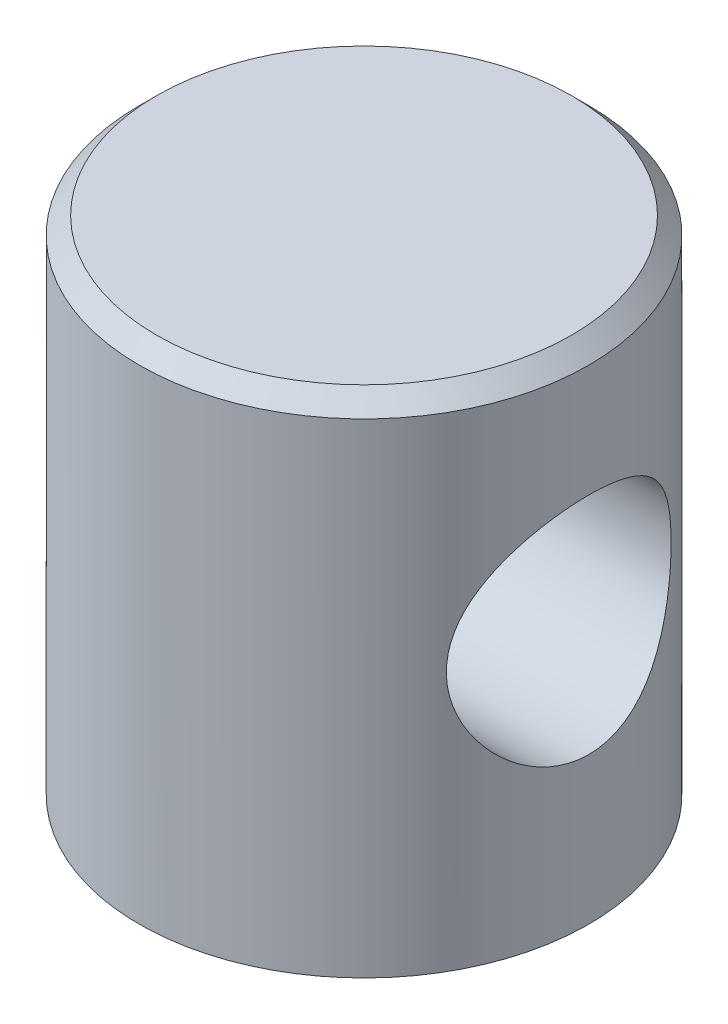
ISO-10303-21;
HEADER;
FILE_DESCRIPTION(('STEP AP214'),'2;1');
FILE_NAME('part.step','',(''),(''),'','','');
FILE_SCHEMA(('AUTOMOTIVE_DESIGN { 1 0 10303 214 1 1 1 1 }'));
ENDSEC;
DATA;
#1=APPLICATION_CONTEXT('core data for automotive mechanical design processes');
#2=APPLICATION_PROTOCOL_DEFINITION('international standard','automotive_design',2000,#1);
#3=PRODUCT_CONTEXT('',#1,'mechanical');
#4=PRODUCT('Part','Part','',(#3));
#5=PRODUCT_RELATED_PRODUCT_CATEGORY('part','',(#4));
#6=PRODUCT_DEFINITION_FORMATION('','',#4);
#7=PRODUCT_DEFINITION_CONTEXT('part definition',#1,'design');
#8=PRODUCT_DEFINITION('design','',#6,#7);
#9=PRODUCT_DEFINITION_SHAPE('','',#8);
#10=(LENGTH_UNIT() NAMED_UNIT(*) SI_UNIT(.MILLI.,.METRE.));
#11=(NAMED_UNIT(*) PLANE_ANGLE_UNIT() SI_UNIT($,.RADIAN.));
#12=(NAMED_UNIT(*) SI_UNIT($,.STERADIAN.) SOLID_ANGLE_UNIT());
#13=UNCERTAINTY_MEASURE_WITH_UNIT(LENGTH_MEASURE(1.E-05),#10,'distance_accuracy_value','');
#14=(GEOMETRIC_REPRESENTATION_CONTEXT(3) GLOBAL_UNCERTAINTY_ASSIGNED_CONTEXT((#13)) GLOBAL_UNIT_ASSIGNED_CONTEXT((#10,
#11,#12)) REPRESENTATION_CONTEXT('',''));
#15=CARTESIAN_POINT('',(0.,0.,0.));
#16=DIRECTION('',(0.,0.,1.));
#17=DIRECTION('',(1.,0.,0.));
#18=AXIS2_PLACEMENT_3D('',#15,#16,#17);
#19=CARTESIAN_POINT('',(0.,29.,0.));
#20=DIRECTION('',(0.,1.,0.));
#21=DIRECTION('',(0.,0.,1.));
#22=AXIS2_PLACEMENT_3D('',#19,#20,#21);
#23=PLANE('',#22);
#24=CARTESIAN_POINT('',(0.,29.,0.));
#25=DIRECTION('',(0.,-1.,0.));
#26=DIRECTION('',(1.,0.,0.));
#27=AXIS2_PLACEMENT_3D('',#24,#25,#26);
#28=CIRCLE('',#27,12.);
#29=CARTESIAN_POINT('',(12.,29.,0.));
#30=VERTEX_POINT('',#29);
#31=EDGE_CURVE('E18',#30,#30,#28,.T.);
#32=ORIENTED_EDGE('',*,*,#31,.F.);
#33=EDGE_LOOP('',(#32));
#34=FACE_BOUND('',#33,.T.);
#35=ADVANCED_FACE('F15',(#34),#23,.T.);
#36=CARTESIAN_POINT('',(-13.,15.,0.));
#37=DIRECTION('',(1.,0.,0.));
#38=DIRECTION('',(0.,0.,-1.));
#39=AXIS2_PLACEMENT_3D('',#36,#37,#38);
#40=CYLINDRICAL_SURFACE('',#39,6.5);
#41=CARTESIAN_POINT('',(-11.2583302491977,15.,6.5));
#42=CARTESIAN_POINT('',(-11.2583250394666,14.8304429338332,6.50000417587094));
#43=CARTESIAN_POINT('',(-11.2621706977341,14.6609265869371,6.49336042577015));
#44=CARTESIAN_POINT('',(-11.2773938745106,14.323213640338,6.46688760099194));
#45=CARTESIAN_POINT('',(-11.2887730541138,14.1550173399749,6.44705561838771));
#46=CARTESIAN_POINT('',(-11.3186550215828,13.8211733194013,6.39444724490961));
#47=CARTESIAN_POINT('',(-11.3371637565646,13.6555278472488,6.36166004685751));
#48=CARTESIAN_POINT('',(-11.3806472846473,13.3280274733578,6.28353910162168));
#49=CARTESIAN_POINT('',(-11.4056248170868,13.1661742092447,6.23820003854334));
#50=CARTESIAN_POINT('',(-11.4610574841517,12.8482066200836,6.13575812811839));
#51=CARTESIAN_POINT('',(-11.4914819627327,12.6920657829664,6.07872087058644));
#52=CARTESIAN_POINT('',(-11.5569727884046,12.3854077888829,5.95326706111101));
#53=CARTESIAN_POINT('',(-11.5920409283451,12.2348928329136,5.88484611146094));
#54=CARTESIAN_POINT('',(-11.7027284710772,11.79296447521,5.66333577567358));
#55=CARTESIAN_POINT('',(-11.7838755452002,11.5109263720826,5.493920356098));
#56=CARTESIAN_POINT('',(-11.9598042386834,10.9549643220656,5.10032137923608));
#57=CARTESIAN_POINT('',(-12.0551583743831,10.6836237378996,4.87277532307248));
#58=CARTESIAN_POINT('',(-12.2441913107114,10.180819625035,4.37609513496608));
#59=CARTESIAN_POINT('',(-12.3378693170286,9.94937457640184,4.10694183898347));
#60=CARTESIAN_POINT('',(-12.4732986352787,9.62940243183281,3.66642907613613));
#61=CARTESIAN_POINT('',(-12.5189174480309,9.52450974060412,3.50789226933481));
#62=CARTESIAN_POINT('',(-12.6058428876328,9.32858118490194,3.181384083434));
#63=CARTESIAN_POINT('',(-12.647151351037,9.23753941119036,3.01341676979547));
#64=CARTESIAN_POINT('',(-12.7242635053198,9.07021136967254,2.66912739703912));
#65=CARTESIAN_POINT('',(-12.7600685184486,8.9939215564436,2.49280735809355));
#66=CARTESIAN_POINT('',(-12.8251140555603,8.85693990025399,2.1330366361343));
#67=CARTESIAN_POINT('',(-12.8543552767395,8.79624640057635,1.94958671287722));
#68=CARTESIAN_POINT('',(-12.9035440020168,8.69498122281748,1.59030063506144));
#69=CARTESIAN_POINT('',(-12.9240046731861,8.65328524446651,1.41485125476122));
#70=CARTESIAN_POINT('',(-12.9578995994311,8.58454531704622,1.0604328145889));
#71=CARTESIAN_POINT('',(-12.9713341600019,8.55750073093289,0.88146390809684));
#72=CARTESIAN_POINT('',(-12.9907816507231,8.51843422152876,0.521583724172345));
#73=CARTESIAN_POINT('',(-12.9967983376979,8.50640469373767,0.340673476812224));
#74=CARTESIAN_POINT('',(-13.0012438438873,8.4975113855094,-0.0216080831377527));
#75=CARTESIAN_POINT('',(-12.9996731273116,8.50064667726376,-0.202979366842075));
#76=CARTESIAN_POINT('',(-12.989460527911,8.52109959145894,-0.548804040867405));
#77=CARTESIAN_POINT('',(-12.9814477099306,8.53715564033413,-0.71335251943211));
#78=CARTESIAN_POINT('',(-12.9593375022288,8.58168224501733,-1.04040418490153));
#79=CARTESIAN_POINT('',(-12.9452380527277,8.61015700348005,-1.20290666024095));
#80=CARTESIAN_POINT('',(-12.9112982044707,8.67919914122871,-1.5246440338146));
#81=CARTESIAN_POINT('',(-12.8914598136304,8.71976229123089,-1.68388005407007));
#82=CARTESIAN_POINT('',(-12.8464948803114,8.81258709503103,-1.99819655858321));
#83=CARTESIAN_POINT('',(-12.8213663126058,8.86485322954548,-2.15327542566143));
#84=CARTESIAN_POINT('',(-12.7660179089786,8.98137238495601,-2.46037527383678));
#85=CARTESIAN_POINT('',(-12.7357343171318,9.04577675309401,-2.61232735977088));
#86=CARTESIAN_POINT('',(-12.6709908767626,9.18554935940894,-2.91020058976585));
#87=CARTESIAN_POINT('',(-12.6365295199448,9.26092155927317,-3.05611953003487));
#88=CARTESIAN_POINT('',(-12.5279725824709,9.50264535689729,-3.4836980355166));
#89=CARTESIAN_POINT('',(-12.4486682956217,9.68467727718431,-3.75537035215971));
#90=CARTESIAN_POINT('',(-12.2748888801356,10.1048092923267,-4.29114431598939));
#91=CARTESIAN_POINT('',(-12.1796883254964,10.3465809144854,-4.55210803276163));
#92=CARTESIAN_POINT('',(-11.9895370964079,10.8698288591281,-5.03165649447651));
#93=CARTESIAN_POINT('',(-11.8945867424487,11.1513424260613,-5.25020102442168));
#94=CARTESIAN_POINT('',(-11.757053021353,11.6086474848291,-5.54840380698228));
#95=CARTESIAN_POINT('',(-11.7107342609208,11.7723626752321,-5.64523758249089));
#96=CARTESIAN_POINT('',(-11.6225676134421,12.1085706983708,-5.82459343885454));
#97=CARTESIAN_POINT('',(-11.5807177429469,12.2810595864268,-5.90712187913665));
#98=CARTESIAN_POINT('',(-11.5030754254437,12.6335193720599,-6.05692814263665));
#99=CARTESIAN_POINT('',(-11.4672733028043,12.8134777335243,-6.12423038552565));
#100=CARTESIAN_POINT('',(-11.4031008380229,13.1797762890688,-6.24290293942399));
#101=CARTESIAN_POINT('',(-11.37472722986,13.3661136376789,-6.29428025382137));
#102=CARTESIAN_POINT('',(-11.3207019273939,13.7905408429517,-6.39105254689689));
#103=CARTESIAN_POINT('',(-11.2974642564575,14.0300195893946,-6.43181542754678));
#104=CARTESIAN_POINT('',(-11.2662834865318,14.5130273447462,-6.48628380484986));
#105=CARTESIAN_POINT('',(-11.2583377291552,14.7565556422441,-6.49999400442434));
#106=CARTESIAN_POINT('',(-11.2583250394666,15.1695570661668,-6.50000417587094));
#107=CARTESIAN_POINT('',(-11.2621706977341,15.3390734130629,-6.49336042577015));
#108=CARTESIAN_POINT('',(-11.2773938745106,15.676786359662,-6.46688760099194));
#109=CARTESIAN_POINT('',(-11.2887730541138,15.8449826600251,-6.44705561838771));
#110=CARTESIAN_POINT('',(-11.3186550215828,16.1788266805987,-6.39444724490961));
#111=CARTESIAN_POINT('',(-11.3371637565646,16.3444721527512,-6.36166004685751));
#112=CARTESIAN_POINT('',(-11.3806472846473,16.6719725266422,-6.28353910162168));
#113=CARTESIAN_POINT('',(-11.4056248170868,16.8338257907553,-6.23820003854334));
#114=CARTESIAN_POINT('',(-11.4610574841517,17.1517933799164,-6.13575812811839));
#115=CARTESIAN_POINT('',(-11.4914819627327,17.3079342170336,-6.07872087058644));
#116=CARTESIAN_POINT('',(-11.5569727884046,17.6145922111171,-5.95326706111101));
#117=CARTESIAN_POINT('',(-11.5920409283451,17.7651071670864,-5.88484611146094));
#118=CARTESIAN_POINT('',(-11.7027284710772,18.20703552479,-5.66333577567358));
#119=CARTESIAN_POINT('',(-11.7838755452002,18.4890736279174,-5.493920356098));
#120=CARTESIAN_POINT('',(-11.9598042386834,19.0450356779344,-5.10032137923608));
#121=CARTESIAN_POINT('',(-12.0551583743831,19.3163762621004,-4.87277532307248));
#122=CARTESIAN_POINT('',(-12.2441913107114,19.819180374965,-4.37609513496608));
#123=CARTESIAN_POINT('',(-12.3378693170286,20.0506254235981,-4.10694183898347));
#124=CARTESIAN_POINT('',(-12.4732986352787,20.3705975681672,-3.66642907613614));
#125=CARTESIAN_POINT('',(-12.5189174480309,20.4754902593959,-3.50789226933482));
#126=CARTESIAN_POINT('',(-12.6058428876328,20.6714188150981,-3.181384083434));
#127=CARTESIAN_POINT('',(-12.647151351037,20.7624605888096,-3.01341676979548));
#128=CARTESIAN_POINT('',(-12.7242635053198,20.9297886303275,-2.66912739703912));
#129=CARTESIAN_POINT('',(-12.7600685184486,21.0060784435564,-2.49280735809356));
#130=CARTESIAN_POINT('',(-12.8251140555603,21.143060099746,-2.13303663613431));
#131=CARTESIAN_POINT('',(-12.8543552767395,21.2037535994236,-1.94958671287723));
#132=CARTESIAN_POINT('',(-12.9035440020168,21.3050187771825,-1.59030063506144));
#133=CARTESIAN_POINT('',(-12.9240046731861,21.3467147555335,-1.41485125476123));
#134=CARTESIAN_POINT('',(-12.9578995994311,21.4154546829538,-1.0604328145889));
#135=CARTESIAN_POINT('',(-12.9713341600019,21.4424992690671,-0.881463908096842));
#136=CARTESIAN_POINT('',(-12.9907816507231,21.4815657784712,-0.521583724172347));
#137=CARTESIAN_POINT('',(-12.9967983376979,21.4935953062623,-0.340673476812226));
#138=CARTESIAN_POINT('',(-13.0012438438873,21.5024886144906,0.0216080831377499));
#139=CARTESIAN_POINT('',(-12.9996731273116,21.4993533227362,0.202979366842072));
#140=CARTESIAN_POINT('',(-12.989460527911,21.4789004085411,0.5488040408674));
#141=CARTESIAN_POINT('',(-12.9814477099306,21.4628443596659,0.713352519432104));
#142=CARTESIAN_POINT('',(-12.9593375022288,21.4183177549827,1.04040418490152));
#143=CARTESIAN_POINT('',(-12.9452380527277,21.3898429965199,1.20290666024094));
#144=CARTESIAN_POINT('',(-12.9112982044707,21.3208008587713,1.52464403381459));
#145=CARTESIAN_POINT('',(-12.8914598136304,21.2802377087691,1.68388005407007));
#146=CARTESIAN_POINT('',(-12.8464948803114,21.187412904969,1.9981965585832));
#147=CARTESIAN_POINT('',(-12.8213663126058,21.1351467704545,2.15327542566142));
#148=CARTESIAN_POINT('',(-12.7660179089786,21.018627615044,2.46037527383677));
#149=CARTESIAN_POINT('',(-12.7357343171318,20.954223246906,2.61232735977088));
#150=CARTESIAN_POINT('',(-12.6709908767626,20.8144506405911,2.91020058976584));
#151=CARTESIAN_POINT('',(-12.6365295199448,20.7390784407268,3.05611953003487));
#152=CARTESIAN_POINT('',(-12.5279725824709,20.4973546431027,3.48369803551659));
#153=CARTESIAN_POINT('',(-12.4486682956217,20.3153227228157,3.75537035215971));
#154=CARTESIAN_POINT('',(-12.2748888801356,19.8951907076733,4.29114431598939));
#155=CARTESIAN_POINT('',(-12.1796883254964,19.6534190855146,4.55210803276163));
#156=CARTESIAN_POINT('',(-11.9895370964079,19.1301711408719,5.0316564944765));
#157=CARTESIAN_POINT('',(-11.8945867424487,18.8486575739387,5.25020102442168));
#158=CARTESIAN_POINT('',(-11.757053021353,18.3913525151709,5.54840380698228));
#159=CARTESIAN_POINT('',(-11.7107342609208,18.2276373247679,5.64523758249089));
#160=CARTESIAN_POINT('',(-11.6225676134421,17.8914293016291,5.82459343885454));
#161=CARTESIAN_POINT('',(-11.5807177429469,17.7189404135732,5.90712187913665));
#162=CARTESIAN_POINT('',(-11.5030754254437,17.3664806279401,6.05692814263665));
#163=CARTESIAN_POINT('',(-11.4672733028043,17.1865222664757,6.12423038552565));
#164=CARTESIAN_POINT('',(-11.4031008380229,16.8202237109312,6.24290293942399));
#165=CARTESIAN_POINT('',(-11.37472722986,16.6338863623211,6.29428025382137));
#166=CARTESIAN_POINT('',(-11.3207019273939,16.2094591570483,6.39105254689689));
#167=CARTESIAN_POINT('',(-11.2974642564575,15.9699804106054,6.43181542754678));
#168=CARTESIAN_POINT('',(-11.2662834865318,15.4869726552538,6.48628380484986));
#169=CARTESIAN_POINT('',(-11.2583377291552,15.2434443577559,6.49999400442434));
#170=CARTESIAN_POINT('',(-11.2583302491977,15.,6.5));
#171=B_SPLINE_CURVE_WITH_KNOTS('',3,(#41,#42,#43,#44,#45,#46,#47,#48,#49,#50,#51,#52,#53,#54,
#55,#56,#57,#58,#59,#60,#61,#62,#63,#64,#65,#66,#67,#68,#69,#70,#71,#72,#73,#74,#75,#76,#77,#78,
#79,#80,#81,#82,#83,#84,#85,#86,#87,#88,#89,#90,#91,#92,#93,#94,#95,#96,#97,#98,#99,#100,#101,
#102,#103,#104,#105,#106,#107,#108,#109,#110,#111,#112,#113,#114,#115,#116,#117,#118,#119,#120,
#121,#122,#123,#124,#125,#126,#127,#128,#129,#130,#131,#132,#133,#134,#135,#136,#137,#138,#139,
#140,#141,#142,#143,#144,#145,#146,#147,#148,#149,#150,#151,#152,#153,#154,#155,#156,#157,#158,
#159,#160,#161,#162,#163,#164,#165,#166,#167,#168,#169,#170),.UNSPECIFIED.,.T.,.F.,(4,2,2,2,2,2,
2,2,2,2,2,2,2,2,2,2,2,2,2,2,2,2,2,2,2,2,2,2,2,2,2,2,2,2,2,2,2,2,2,2,2,2,2,2,2,2,2,2,2,2,2,2,2,2,
2,2,2,2,2,2,2,2,2,2,4),(0.,0.508428934269001,1.01697001128096,1.52593620946703,2.03511829275243,
2.5415199127946,3.04811762025751,4.06054884590395,5.15640042139898,6.25275825164347,
6.83859800289212,7.4241871112863,8.00963530631333,8.59502128642859,9.1387630307602,
9.68248113124893,10.2259237493348,10.7693331191333,11.26531904186,11.7614729431478,
12.2574534618081,12.7536242020052,13.2564486862891,13.759455248589,14.7648519750871,
15.865197249581,16.9665806518371,17.5532434388956,18.1396447527976,18.7250988259636,
19.3102950644679,20.0404072389974,20.7703924773943,21.2788214116633,21.7873624886752,
22.2963286868613,22.8055107701467,23.3119123901889,23.8185100976518,24.8309413232982,
25.9267928987932,27.0231507290377,27.6089904802864,28.1945795886806,28.7800277837076,
29.3654137638229,29.9091555081545,30.4528736086432,30.9963162267291,31.5397255965276,
32.0357115192543,32.5318654205421,33.0278459392024,33.5240166793994,34.0268411636834,
34.5298477259833,35.5352444524814,36.6355897269753,37.7369731292313,38.3236359162899,
38.9100372301919,39.4954913033579,40.0806875418622,40.8107997163917,41.5407849547885),.UNSPECIFIED.);
#172=CARTESIAN_POINT('',(-11.2583302491977,15.,6.5));
#173=VERTEX_POINT('',#172);
#174=EDGE_CURVE('E34',#173,#173,#171,.T.);
#175=ORIENTED_EDGE('',*,*,#174,.F.);
#176=EDGE_LOOP('',(#175));
#177=FACE_BOUND('',#176,.T.);
#178=CARTESIAN_POINT('',(11.2583302491977,15.,-6.5));
#179=CARTESIAN_POINT('',(11.2583250394666,14.8304429338332,-6.50000417587094));
#180=CARTESIAN_POINT('',(11.2621706977341,14.6609265869371,-6.49336042577015));
#181=CARTESIAN_POINT('',(11.2773938745106,14.323213640338,-6.46688760099194));
#182=CARTESIAN_POINT('',(11.2887730541138,14.1550173399749,-6.44705561838771));
#183=CARTESIAN_POINT('',(11.3186550215828,13.8211733194013,-6.39444724490961));
#184=CARTESIAN_POINT('',(11.3371637565646,13.6555278472488,-6.36166004685751));
#185=CARTESIAN_POINT('',(11.3806472846473,13.3280274733578,-6.28353910162168));
#186=CARTESIAN_POINT('',(11.4056248170868,13.1661742092447,-6.23820003854334));
#187=CARTESIAN_POINT('',(11.4610574841517,12.8482066200836,-6.13575812811839));
#188=CARTESIAN_POINT('',(11.4914819627327,12.6920657829664,-6.07872087058644));
#189=CARTESIAN_POINT('',(11.5569727884046,12.3854077888829,-5.95326706111101));
#190=CARTESIAN_POINT('',(11.5920409283451,12.2348928329136,-5.88484611146094));
#191=CARTESIAN_POINT('',(11.7027284710772,11.79296447521,-5.66333577567358));
#192=CARTESIAN_POINT('',(11.7838755452002,11.5109263720826,-5.493920356098));
#193=CARTESIAN_POINT('',(11.9598042386834,10.9549643220656,-5.10032137923608));
#194=CARTESIAN_POINT('',(12.0551583743831,10.6836237378996,-4.87277532307248));
#195=CARTESIAN_POINT('',(12.2441913107114,10.180819625035,-4.37609513496608));
#196=CARTESIAN_POINT('',(12.3378693170286,9.94937457640184,-4.10694183898347));
#197=CARTESIAN_POINT('',(12.4732986352787,9.62940243183281,-3.66642907613613));
#198=CARTESIAN_POINT('',(12.5189174480309,9.52450974060412,-3.50789226933481));
#199=CARTESIAN_POINT('',(12.6058428876328,9.32858118490194,-3.181384083434));
#200=CARTESIAN_POINT('',(12.647151351037,9.23753941119036,-3.01341676979547));
#201=CARTESIAN_POINT('',(12.7242635053198,9.07021136967254,-2.66912739703912));
#202=CARTESIAN_POINT('',(12.7600685184486,8.9939215564436,-2.49280735809355));
#203=CARTESIAN_POINT('',(12.8251140555603,8.85693990025399,-2.1330366361343));
#204=CARTESIAN_POINT('',(12.8543552767395,8.79624640057635,-1.94958671287722));
#205=CARTESIAN_POINT('',(12.9035440020168,8.69498122281748,-1.59030063506144));
#206=CARTESIAN_POINT('',(12.9240046731861,8.65328524446651,-1.41485125476122));
#207=CARTESIAN_POINT('',(12.9578995994311,8.58454531704622,-1.0604328145889));
#208=CARTESIAN_POINT('',(12.9713341600019,8.55750073093289,-0.88146390809684));
#209=CARTESIAN_POINT('',(12.9907816507231,8.51843422152876,-0.521583724172345));
#210=CARTESIAN_POINT('',(12.9967983376979,8.50640469373767,-0.340673476812224));
#211=CARTESIAN_POINT('',(13.0012438438873,8.4975113855094,0.0216080831377527));
#212=CARTESIAN_POINT('',(12.9996731273116,8.50064667726376,0.202979366842075));
#213=CARTESIAN_POINT('',(12.989460527911,8.52109959145894,0.548804040867405));
#214=CARTESIAN_POINT('',(12.9814477099306,8.53715564033413,0.71335251943211));
#215=CARTESIAN_POINT('',(12.9593375022288,8.58168224501733,1.04040418490153));
#216=CARTESIAN_POINT('',(12.9452380527277,8.61015700348005,1.20290666024095));
#217=CARTESIAN_POINT('',(12.9112982044707,8.67919914122871,1.5246440338146));
#218=CARTESIAN_POINT('',(12.8914598136304,8.71976229123089,1.68388005407007));
#219=CARTESIAN_POINT('',(12.8464948803114,8.81258709503103,1.99819655858321));
#220=CARTESIAN_POINT('',(12.8213663126058,8.86485322954548,2.15327542566143));
#221=CARTESIAN_POINT('',(12.7660179089786,8.98137238495601,2.46037527383678));
#222=CARTESIAN_POINT('',(12.7357343171318,9.04577675309401,2.61232735977088));
#223=CARTESIAN_POINT('',(12.6709908767626,9.18554935940894,2.91020058976585));
#224=CARTESIAN_POINT('',(12.6365295199448,9.26092155927317,3.05611953003487));
#225=CARTESIAN_POINT('',(12.5279725824709,9.50264535689729,3.4836980355166));
#226=CARTESIAN_POINT('',(12.4486682956217,9.68467727718431,3.75537035215971));
#227=CARTESIAN_POINT('',(12.2748888801356,10.1048092923267,4.29114431598939));
#228=CARTESIAN_POINT('',(12.1796883254964,10.3465809144854,4.55210803276163));
#229=CARTESIAN_POINT('',(11.9895370964079,10.8698288591281,5.03165649447651));
#230=CARTESIAN_POINT('',(11.8945867424487,11.1513424260613,5.25020102442168));
#231=CARTESIAN_POINT('',(11.757053021353,11.6086474848291,5.54840380698228));
#232=CARTESIAN_POINT('',(11.7107342609208,11.7723626752321,5.64523758249089));
#233=CARTESIAN_POINT('',(11.6225676134421,12.1085706983708,5.82459343885454));
#234=CARTESIAN_POINT('',(11.5807177429469,12.2810595864268,5.90712187913665));
#235=CARTESIAN_POINT('',(11.5030754254437,12.6335193720599,6.05692814263665));
#236=CARTESIAN_POINT('',(11.4672733028043,12.8134777335243,6.12423038552565));
#237=CARTESIAN_POINT('',(11.4031008380229,13.1797762890688,6.24290293942399));
#238=CARTESIAN_POINT('',(11.37472722986,13.3661136376789,6.29428025382137));
#239=CARTESIAN_POINT('',(11.3207019273939,13.7905408429517,6.39105254689689));
#240=CARTESIAN_POINT('',(11.2974642564575,14.0300195893946,6.43181542754678));
#241=CARTESIAN_POINT('',(11.2662834865318,14.5130273447462,6.48628380484986));
#242=CARTESIAN_POINT('',(11.2583377291552,14.7565556422441,6.49999400442434));
#243=CARTESIAN_POINT('',(11.2583250394666,15.1695570661668,6.50000417587094));
#244=CARTESIAN_POINT('',(11.2621706977341,15.3390734130629,6.49336042577015));
#245=CARTESIAN_POINT('',(11.2773938745106,15.676786359662,6.46688760099194));
#246=CARTESIAN_POINT('',(11.2887730541138,15.8449826600251,6.44705561838771));
#247=CARTESIAN_POINT('',(11.3186550215828,16.1788266805987,6.39444724490961));
#248=CARTESIAN_POINT('',(11.3371637565646,16.3444721527512,6.36166004685751));
#249=CARTESIAN_POINT('',(11.3806472846473,16.6719725266422,6.28353910162168));
#250=CARTESIAN_POINT('',(11.4056248170868,16.8338257907553,6.23820003854334));
#251=CARTESIAN_POINT('',(11.4610574841517,17.1517933799164,6.13575812811839));
#252=CARTESIAN_POINT('',(11.4914819627327,17.3079342170336,6.07872087058644));
#253=CARTESIAN_POINT('',(11.5569727884046,17.6145922111171,5.95326706111101));
#254=CARTESIAN_POINT('',(11.5920409283451,17.7651071670864,5.88484611146094));
#255=CARTESIAN_POINT('',(11.7027284710772,18.20703552479,5.66333577567358));
#256=CARTESIAN_POINT('',(11.7838755452002,18.4890736279174,5.493920356098));
#257=CARTESIAN_POINT('',(11.9598042386834,19.0450356779344,5.10032137923608));
#258=CARTESIAN_POINT('',(12.0551583743831,19.3163762621004,4.87277532307248));
#259=CARTESIAN_POINT('',(12.2441913107114,19.819180374965,4.37609513496608));
#260=CARTESIAN_POINT('',(12.3378693170286,20.0506254235982,4.10694183898347));
#261=CARTESIAN_POINT('',(12.4732986352787,20.3705975681672,3.66642907613613));
#262=CARTESIAN_POINT('',(12.5189174480309,20.4754902593959,3.50789226933481));
#263=CARTESIAN_POINT('',(12.6058428876328,20.6714188150981,3.181384083434));
#264=CARTESIAN_POINT('',(12.647151351037,20.7624605888096,3.01341676979548));
#265=CARTESIAN_POINT('',(12.7242635053198,20.9297886303275,2.66912739703912));
#266=CARTESIAN_POINT('',(12.7600685184486,21.0060784435564,2.49280735809356));
#267=CARTESIAN_POINT('',(12.8251140555603,21.143060099746,2.13303663613431));
#268=CARTESIAN_POINT('',(12.8543552767395,21.2037535994236,1.94958671287723));
#269=CARTESIAN_POINT('',(12.9035440020168,21.3050187771825,1.59030063506144));
#270=CARTESIAN_POINT('',(12.9240046731861,21.3467147555335,1.41485125476123));
#271=CARTESIAN_POINT('',(12.9578995994311,21.4154546829538,1.0604328145889));
#272=CARTESIAN_POINT('',(12.9713341600019,21.4424992690671,0.881463908096842));
#273=CARTESIAN_POINT('',(12.9907816507231,21.4815657784712,0.521583724172347));
#274=CARTESIAN_POINT('',(12.9967983376979,21.4935953062623,0.340673476812226));
#275=CARTESIAN_POINT('',(13.0012438438873,21.5024886144906,-0.0216080831377499));
#276=CARTESIAN_POINT('',(12.9996731273116,21.4993533227362,-0.202979366842072));
#277=CARTESIAN_POINT('',(12.989460527911,21.4789004085411,-0.5488040408674));
#278=CARTESIAN_POINT('',(12.9814477099306,21.4628443596659,-0.713352519432104));
#279=CARTESIAN_POINT('',(12.9593375022288,21.4183177549827,-1.04040418490152));
#280=CARTESIAN_POINT('',(12.9452380527277,21.3898429965199,-1.20290666024094));
#281=CARTESIAN_POINT('',(12.9112982044707,21.3208008587713,-1.52464403381459));
#282=CARTESIAN_POINT('',(12.8914598136304,21.2802377087691,-1.68388005407007));
#283=CARTESIAN_POINT('',(12.8464948803114,21.187412904969,-1.9981965585832));
#284=CARTESIAN_POINT('',(12.8213663126058,21.1351467704545,-2.15327542566142));
#285=CARTESIAN_POINT('',(12.7660179089786,21.018627615044,-2.46037527383677));
#286=CARTESIAN_POINT('',(12.7357343171318,20.954223246906,-2.61232735977088));
#287=CARTESIAN_POINT('',(12.6709908767626,20.8144506405911,-2.91020058976584));
#288=CARTESIAN_POINT('',(12.6365295199448,20.7390784407268,-3.05611953003487));
#289=CARTESIAN_POINT('',(12.5279725824709,20.4973546431027,-3.48369803551659));
#290=CARTESIAN_POINT('',(12.4486682956217,20.3153227228157,-3.75537035215971));
#291=CARTESIAN_POINT('',(12.2748888801356,19.8951907076733,-4.29114431598939));
#292=CARTESIAN_POINT('',(12.1796883254964,19.6534190855146,-4.55210803276163));
#293=CARTESIAN_POINT('',(11.9895370964079,19.1301711408719,-5.0316564944765));
#294=CARTESIAN_POINT('',(11.8945867424487,18.8486575739387,-5.25020102442168));
#295=CARTESIAN_POINT('',(11.757053021353,18.3913525151709,-5.54840380698228));
#296=CARTESIAN_POINT('',(11.7107342609208,18.2276373247679,-5.64523758249089));
#297=CARTESIAN_POINT('',(11.6225676134421,17.8914293016291,-5.82459343885454));
#298=CARTESIAN_POINT('',(11.5807177429469,17.7189404135732,-5.90712187913665));
#299=CARTESIAN_POINT('',(11.5030754254437,17.3664806279401,-6.05692814263665));
#300=CARTESIAN_POINT('',(11.4672733028043,17.1865222664757,-6.12423038552565));
#301=CARTESIAN_POINT('',(11.4031008380229,16.8202237109312,-6.24290293942399));
#302=CARTESIAN_POINT('',(11.37472722986,16.6338863623211,-6.29428025382137));
#303=CARTESIAN_POINT('',(11.3207019273939,16.2094591570483,-6.39105254689689));
#304=CARTESIAN_POINT('',(11.2974642564575,15.9699804106054,-6.43181542754678));
#305=CARTESIAN_POINT('',(11.2662834865318,15.4869726552538,-6.48628380484986));
#306=CARTESIAN_POINT('',(11.2583377291552,15.2434443577559,-6.49999400442434));
#307=CARTESIAN_POINT('',(11.2583302491977,15.,-6.5));
#308=B_SPLINE_CURVE_WITH_KNOTS('',3,(#178,#179,#180,#181,#182,#183,#184,#185,#186,#187,#188,
#189,#190,#191,#192,#193,#194,#195,#196,#197,#198,#199,#200,#201,#202,#203,#204,#205,#206,#207,
#208,#209,#210,#211,#212,#213,#214,#215,#216,#217,#218,#219,#220,#221,#222,#223,#224,#225,#226,
#227,#228,#229,#230,#231,#232,#233,#234,#235,#236,#237,#238,#239,#240,#241,#242,#243,#244,#245,
#246,#247,#248,#249,#250,#251,#252,#253,#254,#255,#256,#257,#258,#259,#260,#261,#262,#263,#264,
#265,#266,#267,#268,#269,#270,#271,#272,#273,#274,#275,#276,#277,#278,#279,#280,#281,#282,#283,
#284,#285,#286,#287,#288,#289,#290,#291,#292,#293,#294,#295,#296,#297,#298,#299,#300,#301,#302,
#303,#304,#305,#306,#307),.UNSPECIFIED.,.T.,.F.,(4,2,2,2,2,2,2,2,2,2,2,2,2,2,2,2,2,2,2,2,2,2,2,
2,2,2,2,2,2,2,2,2,2,2,2,2,2,2,2,2,2,2,2,2,2,2,2,2,2,2,2,2,2,2,2,2,2,2,2,2,2,2,2,2,4),(0.,
0.508428934269001,1.01697001128096,1.52593620946703,2.03511829275243,2.5415199127946,
3.04811762025751,4.06054884590395,5.15640042139898,6.25275825164347,6.83859800289212,
7.4241871112863,8.00963530631333,8.59502128642859,9.1387630307602,9.68248113124893,
10.2259237493348,10.7693331191333,11.26531904186,11.7614729431478,12.2574534618081,
12.7536242020052,13.2564486862891,13.759455248589,14.7648519750871,15.865197249581,
16.9665806518371,17.5532434388956,18.1396447527976,18.7250988259636,19.3102950644679,
20.0404072389974,20.7703924773943,21.2788214116633,21.7873624886752,22.2963286868613,
22.8055107701467,23.3119123901889,23.8185100976518,24.8309413232982,25.9267928987932,
27.0231507290377,27.6089904802864,28.1945795886806,28.7800277837076,29.3654137638229,
29.9091555081545,30.4528736086432,30.9963162267291,31.5397255965276,32.0357115192543,
32.5318654205421,33.0278459392024,33.5240166793994,34.0268411636834,34.5298477259833,
35.5352444524814,36.6355897269753,37.7369731292313,38.3236359162899,38.9100372301919,
39.4954913033579,40.0806875418622,40.8107997163917,41.5407849547885),.UNSPECIFIED.);
#309=CARTESIAN_POINT('',(11.2583302491977,15.,-6.5));
#310=VERTEX_POINT('',#309);
#311=EDGE_CURVE('E27',#310,#310,#308,.T.);
#312=ORIENTED_EDGE('',*,*,#311,.F.);
#313=EDGE_LOOP('',(#312));
#314=FACE_BOUND('',#313,.T.);
#315=ADVANCED_FACE('F37',(#177,#314),#40,.F.);
#316=CARTESIAN_POINT('',(0.,28.,0.));
#317=DIRECTION('',(0.,-1.,0.));
#318=DIRECTION('',(1.,0.,0.));
#319=AXIS2_PLACEMENT_3D('',#316,#317,#318);
#320=CONICAL_SURFACE('',#319,13.,0.785398163397446);
#321=CARTESIAN_POINT('',(0.,28.,0.));
#322=DIRECTION('',(0.,-1.,0.));
#323=DIRECTION('',(0.,0.,-1.));
#324=AXIS2_PLACEMENT_3D('',#321,#322,#323);
#325=CIRCLE('',#324,13.);
#326=CARTESIAN_POINT('',(0.,28.,-13.));
#327=VERTEX_POINT('',#326);
#328=EDGE_CURVE('E22',#327,#327,#325,.T.);
#329=ORIENTED_EDGE('',*,*,#328,.F.);
#330=EDGE_LOOP('',(#329));
#331=FACE_BOUND('',#330,.T.);
#332=ORIENTED_EDGE('',*,*,#31,.T.);
#333=EDGE_LOOP('',(#332));
#334=FACE_BOUND('',#333,.T.);
#335=ADVANCED_FACE('F47',(#331,#334),#320,.T.);
#336=CARTESIAN_POINT('',(0.,0.,0.));
#337=DIRECTION('',(0.,1.,0.));
#338=DIRECTION('',(0.,0.,1.));
#339=AXIS2_PLACEMENT_3D('',#336,#337,#338);
#340=PLANE('',#339);
#341=CARTESIAN_POINT('',(0.,0.,0.));
#342=DIRECTION('',(0.,-1.,0.));
#343=DIRECTION('',(0.,0.,-1.));
#344=AXIS2_PLACEMENT_3D('',#341,#342,#343);
#345=CIRCLE('',#344,13.);
#346=CARTESIAN_POINT('',(0.,0.,-13.));
#347=VERTEX_POINT('',#346);
#348=EDGE_CURVE('E10',#347,#347,#345,.F.);
#349=ORIENTED_EDGE('',*,*,#348,.F.);
#350=EDGE_LOOP('',(#349));
#351=FACE_BOUND('',#350,.T.);
#352=ADVANCED_FACE('F44',(#351),#340,.F.);
#353=CARTESIAN_POINT('',(0.,29.,0.));
#354=DIRECTION('',(0.,-1.,0.));
#355=DIRECTION('',(0.,0.,-1.));
#356=AXIS2_PLACEMENT_3D('',#353,#354,#355);
#357=CYLINDRICAL_SURFACE('',#356,13.);
#358=ORIENTED_EDGE('',*,*,#348,.T.);
#359=EDGE_LOOP('',(#358));
#360=FACE_BOUND('',#359,.T.);
#361=ORIENTED_EDGE('',*,*,#328,.T.);
#362=EDGE_LOOP('',(#361));
#363=FACE_BOUND('',#362,.T.);
#364=ORIENTED_EDGE('',*,*,#311,.T.);
#365=EDGE_LOOP('',(#364));
#366=FACE_BOUND('',#365,.T.);
#367=ORIENTED_EDGE('',*,*,#174,.T.);
#368=EDGE_LOOP('',(#367));
#369=FACE_BOUND('',#368,.T.);
#370=ADVANCED_FACE('F40',(#360,#363,#366,#369),#357,.T.);
#371=CLOSED_SHELL('',(#35,#315,#335,#352,#370));
#372=MANIFOLD_SOLID_BREP('B1',#371);
#373=ADVANCED_BREP_SHAPE_REPRESENTATION('',(#18,#372),#14);
#374=SHAPE_DEFINITION_REPRESENTATION(#9,#373);
ENDSEC;
END-ISO-10303-21;
